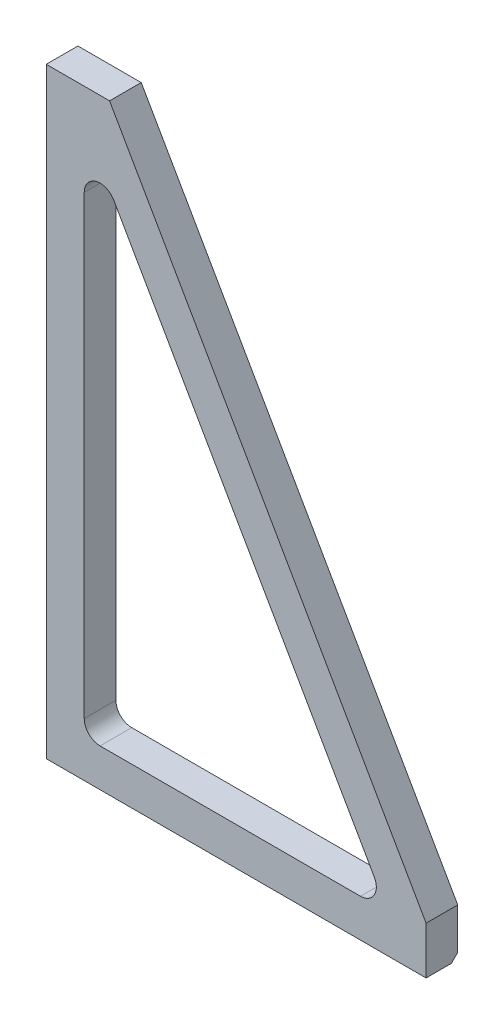
ISO-10303-21;
HEADER;
FILE_DESCRIPTION(('STEP AP214'),'2;1');
FILE_NAME('part.step','',(''),(''),'','','');
FILE_SCHEMA(('AUTOMOTIVE_DESIGN { 1 0 10303 214 1 1 1 1 }'));
ENDSEC;
DATA;
#1=APPLICATION_CONTEXT('core data for automotive mechanical design processes');
#2=APPLICATION_PROTOCOL_DEFINITION('international standard','automotive_design',2000,#1);
#3=PRODUCT_CONTEXT('',#1,'mechanical');
#4=PRODUCT('Part','Part','',(#3));
#5=PRODUCT_RELATED_PRODUCT_CATEGORY('part','',(#4));
#6=PRODUCT_DEFINITION_FORMATION('','',#4);
#7=PRODUCT_DEFINITION_CONTEXT('part definition',#1,'design');
#8=PRODUCT_DEFINITION('design','',#6,#7);
#9=PRODUCT_DEFINITION_SHAPE('','',#8);
#10=(LENGTH_UNIT() NAMED_UNIT(*) SI_UNIT(.MILLI.,.METRE.));
#11=(NAMED_UNIT(*) PLANE_ANGLE_UNIT() SI_UNIT($,.RADIAN.));
#12=(NAMED_UNIT(*) SI_UNIT($,.STERADIAN.) SOLID_ANGLE_UNIT());
#13=UNCERTAINTY_MEASURE_WITH_UNIT(LENGTH_MEASURE(1.E-05),#10,'distance_accuracy_value','');
#14=(GEOMETRIC_REPRESENTATION_CONTEXT(3) GLOBAL_UNCERTAINTY_ASSIGNED_CONTEXT((#13)) GLOBAL_UNIT_ASSIGNED_CONTEXT((#10,
#11,#12)) REPRESENTATION_CONTEXT('',''));
#15=CARTESIAN_POINT('',(0.,0.,0.));
#16=DIRECTION('',(0.,0.,1.));
#17=DIRECTION('',(1.,0.,0.));
#18=AXIS2_PLACEMENT_3D('',#15,#16,#17);
#19=CARTESIAN_POINT('',(0.,241.3,12.7));
#20=DIRECTION('',(0.,0.,-1.));
#21=DIRECTION('',(-1.,0.,0.));
#22=AXIS2_PLACEMENT_3D('',#19,#20,#21);
#23=PLANE('',#22);
#24=DIRECTION('',(0.,-1.,0.));
#25=VECTOR('',#24,1.);
#26=CARTESIAN_POINT('',(0.,0.,12.7));
#27=LINE('',#26,#25);
#28=CARTESIAN_POINT('',(0.,241.3,12.7));
#29=VERTEX_POINT('',#28);
#30=CARTESIAN_POINT('',(0.,0.,12.7));
#31=VERTEX_POINT('',#30);
#32=EDGE_CURVE('E178',#29,#31,#27,.T.);
#33=ORIENTED_EDGE('',*,*,#32,.T.);
#34=DIRECTION('',(1.,0.,0.));
#35=VECTOR('',#34,1.);
#36=CARTESIAN_POINT('',(0.,0.,12.7));
#37=LINE('',#36,#35);
#38=CARTESIAN_POINT('',(152.4,0.,12.7));
#39=VERTEX_POINT('',#38);
#40=EDGE_CURVE('E181',#31,#39,#37,.T.);
#41=ORIENTED_EDGE('',*,*,#40,.T.);
#42=DIRECTION('',(0.,1.,0.));
#43=VECTOR('',#42,1.);
#44=CARTESIAN_POINT('',(152.4,0.,12.7));
#45=LINE('',#44,#43);
#46=CARTESIAN_POINT('',(152.4,19.05,12.7));
#47=VERTEX_POINT('',#46);
#48=EDGE_CURVE('E184',#39,#47,#45,.T.);
#49=ORIENTED_EDGE('',*,*,#48,.T.);
#50=DIRECTION('',(-0.496138938356834,0.868243142124459,0.));
#51=VECTOR('',#50,1.);
#52=CARTESIAN_POINT('',(25.4,241.3,12.7));
#53=LINE('',#52,#51);
#54=CARTESIAN_POINT('',(25.4,241.3,12.7));
#55=VERTEX_POINT('',#54);
#56=EDGE_CURVE('E186',#47,#55,#53,.T.);
#57=ORIENTED_EDGE('',*,*,#56,.T.);
#58=DIRECTION('',(-1.,0.,0.));
#59=VECTOR('',#58,1.);
#60=CARTESIAN_POINT('',(0.,241.3,12.7));
#61=LINE('',#60,#59);
#62=EDGE_CURVE('E188',#55,#29,#61,.T.);
#63=ORIENTED_EDGE('',*,*,#62,.T.);
#64=EDGE_LOOP('',(#33,#41,#49,#57,#63));
#65=FACE_BOUND('',#64,.T.);
#66=CARTESIAN_POINT('',(126.082265030605,21.59,12.7));
#67=DIRECTION('',(0.,0.,1.));
#68=DIRECTION('',(-1.,0.,0.));
#69=AXIS2_PLACEMENT_3D('',#66,#67,#68);
#70=CIRCLE('',#69,6.35);
#71=CARTESIAN_POINT('',(126.082265030605,15.24,12.7));
#72=VERTEX_POINT('',#71);
#73=CARTESIAN_POINT('',(131.595608983095,24.7404822585659,12.7));
#74=VERTEX_POINT('',#73);
#75=EDGE_CURVE('E122',#72,#74,#70,.T.);
#76=ORIENTED_EDGE('',*,*,#75,.F.);
#77=DIRECTION('',(1.,0.,0.));
#78=VECTOR('',#77,1.);
#79=CARTESIAN_POINT('',(21.59,15.24,12.7));
#80=LINE('',#79,#78);
#81=CARTESIAN_POINT('',(21.59,15.24,12.7));
#82=VERTEX_POINT('',#81);
#83=EDGE_CURVE('E154',#82,#72,#80,.T.);
#84=ORIENTED_EDGE('',*,*,#83,.F.);
#85=CARTESIAN_POINT('',(21.59,21.59,12.7));
#86=DIRECTION('',(0.,0.,1.));
#87=DIRECTION('',(1.,0.,0.));
#88=AXIS2_PLACEMENT_3D('',#85,#86,#87);
#89=CIRCLE('',#88,6.35);
#90=CARTESIAN_POINT('',(15.24,21.59,12.7));
#91=VERTEX_POINT('',#90);
#92=EDGE_CURVE('E151',#91,#82,#89,.T.);
#93=ORIENTED_EDGE('',*,*,#92,.F.);
#94=DIRECTION('',(0.,-1.,0.));
#95=VECTOR('',#94,1.);
#96=CARTESIAN_POINT('',(15.24,21.59,12.7));
#97=LINE('',#96,#95);
#98=CARTESIAN_POINT('',(15.24,204.451463803559,12.7));
#99=VERTEX_POINT('',#98);
#100=EDGE_CURVE('E147',#99,#91,#97,.T.);
#101=ORIENTED_EDGE('',*,*,#100,.F.);
#102=CARTESIAN_POINT('',(21.59,204.451463803559,12.7));
#103=DIRECTION('',(0.,0.,1.));
#104=DIRECTION('',(-1.,0.,0.));
#105=AXIS2_PLACEMENT_3D('',#102,#103,#104);
#106=CIRCLE('',#105,6.35000000000001);
#107=CARTESIAN_POINT('',(27.1033439524903,207.601946062124,12.7));
#108=VERTEX_POINT('',#107);
#109=EDGE_CURVE('E145',#108,#99,#106,.T.);
#110=ORIENTED_EDGE('',*,*,#109,.F.);
#111=DIRECTION('',(-0.496138938356834,0.868243142124459,0.));
#112=VECTOR('',#111,1.);
#113=CARTESIAN_POINT('',(27.1033439524903,207.601946062124,12.7));
#114=LINE('',#113,#112);
#115=EDGE_CURVE('E132',#74,#108,#114,.T.);
#116=ORIENTED_EDGE('',*,*,#115,.F.);
#117=EDGE_LOOP('',(#76,#84,#93,#101,#110,#116));
#118=FACE_BOUND('',#117,.T.);
#119=ADVANCED_FACE('F33',(#65,#118),#23,.F.);
#120=CARTESIAN_POINT('',(0.,241.3,0.));
#121=DIRECTION('',(0.,0.,-1.));
#122=DIRECTION('',(-1.,0.,0.));
#123=AXIS2_PLACEMENT_3D('',#120,#121,#122);
#124=PLANE('',#123);
#125=DIRECTION('',(0.,1.,0.));
#126=VECTOR('',#125,1.);
#127=CARTESIAN_POINT('',(152.4,0.,0.));
#128=LINE('',#127,#126);
#129=CARTESIAN_POINT('',(152.4,2.54000000000001,0.));
#130=VERTEX_POINT('',#129);
#131=CARTESIAN_POINT('',(152.4,19.05,0.));
#132=VERTEX_POINT('',#131);
#133=EDGE_CURVE('E192',#130,#132,#128,.T.);
#134=ORIENTED_EDGE('',*,*,#133,.F.);
#135=DIRECTION('',(-1.,0.,0.));
#136=VECTOR('',#135,1.);
#137=CARTESIAN_POINT('',(0.,2.54000000000001,0.));
#138=LINE('',#137,#136);
#139=CARTESIAN_POINT('',(0.,2.54000000000001,0.));
#140=VERTEX_POINT('',#139);
#141=EDGE_CURVE('E41',#130,#140,#138,.T.);
#142=ORIENTED_EDGE('',*,*,#141,.T.);
#143=DIRECTION('',(0.,-1.,0.));
#144=VECTOR('',#143,1.);
#145=CARTESIAN_POINT('',(0.,0.,0.));
#146=LINE('',#145,#144);
#147=CARTESIAN_POINT('',(0.,241.3,0.));
#148=VERTEX_POINT('',#147);
#149=EDGE_CURVE('E140',#148,#140,#146,.T.);
#150=ORIENTED_EDGE('',*,*,#149,.F.);
#151=DIRECTION('',(-1.,0.,0.));
#152=VECTOR('',#151,1.);
#153=CARTESIAN_POINT('',(0.,241.3,0.));
#154=LINE('',#153,#152);
#155=CARTESIAN_POINT('',(25.4,241.3,0.));
#156=VERTEX_POINT('',#155);
#157=EDGE_CURVE('E182',#156,#148,#154,.T.);
#158=ORIENTED_EDGE('',*,*,#157,.F.);
#159=DIRECTION('',(-0.496138938356834,0.868243142124459,0.));
#160=VECTOR('',#159,1.);
#161=CARTESIAN_POINT('',(25.4,241.3,0.));
#162=LINE('',#161,#160);
#163=EDGE_CURVE('E194',#132,#156,#162,.T.);
#164=ORIENTED_EDGE('',*,*,#163,.F.);
#165=EDGE_LOOP('',(#134,#142,#150,#158,#164));
#166=FACE_BOUND('',#165,.T.);
#167=DIRECTION('',(1.,0.,0.));
#168=VECTOR('',#167,1.);
#169=CARTESIAN_POINT('',(21.59,15.24,0.));
#170=LINE('',#169,#168);
#171=CARTESIAN_POINT('',(21.59,15.24,0.));
#172=VERTEX_POINT('',#171);
#173=CARTESIAN_POINT('',(126.082265030605,15.24,0.));
#174=VERTEX_POINT('',#173);
#175=EDGE_CURVE('E133',#172,#174,#170,.T.);
#176=ORIENTED_EDGE('',*,*,#175,.T.);
#177=CARTESIAN_POINT('',(126.082265030605,21.59,0.));
#178=DIRECTION('',(0.,0.,1.));
#179=DIRECTION('',(-1.,0.,0.));
#180=AXIS2_PLACEMENT_3D('',#177,#178,#179);
#181=CIRCLE('',#180,6.35);
#182=CARTESIAN_POINT('',(131.595608983095,24.7404822585659,0.));
#183=VERTEX_POINT('',#182);
#184=EDGE_CURVE('E156',#174,#183,#181,.T.);
#185=ORIENTED_EDGE('',*,*,#184,.T.);
#186=DIRECTION('',(-0.496138938356834,0.868243142124459,0.));
#187=VECTOR('',#186,1.);
#188=CARTESIAN_POINT('',(27.1033439524903,207.601946062124,0.));
#189=LINE('',#188,#187);
#190=CARTESIAN_POINT('',(27.1033439524903,207.601946062124,0.));
#191=VERTEX_POINT('',#190);
#192=EDGE_CURVE('E139',#183,#191,#189,.T.);
#193=ORIENTED_EDGE('',*,*,#192,.T.);
#194=CARTESIAN_POINT('',(21.59,204.451463803559,0.));
#195=DIRECTION('',(0.,0.,1.));
#196=DIRECTION('',(-1.,0.,0.));
#197=AXIS2_PLACEMENT_3D('',#194,#195,#196);
#198=CIRCLE('',#197,6.35000000000001);
#199=CARTESIAN_POINT('',(15.24,204.451463803559,0.));
#200=VERTEX_POINT('',#199);
#201=EDGE_CURVE('E159',#191,#200,#198,.T.);
#202=ORIENTED_EDGE('',*,*,#201,.T.);
#203=DIRECTION('',(0.,-1.,0.));
#204=VECTOR('',#203,1.);
#205=CARTESIAN_POINT('',(15.24,21.59,0.));
#206=LINE('',#205,#204);
#207=CARTESIAN_POINT('',(15.24,21.59,0.));
#208=VERTEX_POINT('',#207);
#209=EDGE_CURVE('E162',#200,#208,#206,.T.);
#210=ORIENTED_EDGE('',*,*,#209,.T.);
#211=CARTESIAN_POINT('',(21.59,21.59,0.));
#212=DIRECTION('',(0.,0.,1.));
#213=DIRECTION('',(1.,0.,0.));
#214=AXIS2_PLACEMENT_3D('',#211,#212,#213);
#215=CIRCLE('',#214,6.35);
#216=EDGE_CURVE('E165',#208,#172,#215,.T.);
#217=ORIENTED_EDGE('',*,*,#216,.T.);
#218=EDGE_LOOP('',(#176,#185,#193,#202,#210,#217));
#219=FACE_BOUND('',#218,.T.);
#220=ADVANCED_FACE('F240',(#166,#219),#124,.T.);
#221=CARTESIAN_POINT('',(0.,0.,12.7));
#222=DIRECTION('',(1.,0.,0.));
#223=DIRECTION('',(0.,0.,-1.));
#224=AXIS2_PLACEMENT_3D('',#221,#222,#223);
#225=PLANE('',#224);
#226=ORIENTED_EDGE('',*,*,#149,.T.);
#227=DIRECTION('',(0.,-0.70710678118655,0.707106781186546));
#228=VECTOR('',#227,1.);
#229=CARTESIAN_POINT('',(0.,0.,2.54));
#230=LINE('',#229,#228);
#231=CARTESIAN_POINT('',(0.,0.,2.54));
#232=VERTEX_POINT('',#231);
#233=EDGE_CURVE('E11',#140,#232,#230,.T.);
#234=ORIENTED_EDGE('',*,*,#233,.T.);
#235=DIRECTION('',(0.,0.,-1.));
#236=VECTOR('',#235,1.);
#237=CARTESIAN_POINT('',(0.,0.,12.7));
#238=LINE('',#237,#236);
#239=EDGE_CURVE('E207',#31,#232,#238,.T.);
#240=ORIENTED_EDGE('',*,*,#239,.F.);
#241=ORIENTED_EDGE('',*,*,#32,.F.);
#242=DIRECTION('',(0.,0.,-1.));
#243=VECTOR('',#242,1.);
#244=CARTESIAN_POINT('',(0.,241.3,12.7));
#245=LINE('',#244,#243);
#246=EDGE_CURVE('E190',#29,#148,#245,.T.);
#247=ORIENTED_EDGE('',*,*,#246,.T.);
#248=EDGE_LOOP('',(#226,#234,#240,#241,#247));
#249=FACE_BOUND('',#248,.T.);
#250=ADVANCED_FACE('F230',(#249),#225,.F.);
#251=CARTESIAN_POINT('',(0.,0.,12.7));
#252=DIRECTION('',(0.,1.,0.));
#253=DIRECTION('',(0.,0.,1.));
#254=AXIS2_PLACEMENT_3D('',#251,#252,#253);
#255=PLANE('',#254);
#256=ORIENTED_EDGE('',*,*,#239,.T.);
#257=DIRECTION('',(1.,0.,0.));
#258=VECTOR('',#257,1.);
#259=CARTESIAN_POINT('',(152.4,0.,2.54));
#260=LINE('',#259,#258);
#261=CARTESIAN_POINT('',(152.4,0.,2.54));
#262=VERTEX_POINT('',#261);
#263=EDGE_CURVE('E210',#232,#262,#260,.T.);
#264=ORIENTED_EDGE('',*,*,#263,.T.);
#265=DIRECTION('',(0.,0.,-1.));
#266=VECTOR('',#265,1.);
#267=CARTESIAN_POINT('',(152.4,0.,12.7));
#268=LINE('',#267,#266);
#269=EDGE_CURVE('E205',#39,#262,#268,.T.);
#270=ORIENTED_EDGE('',*,*,#269,.F.);
#271=ORIENTED_EDGE('',*,*,#40,.F.);
#272=EDGE_LOOP('',(#256,#264,#270,#271));
#273=FACE_BOUND('',#272,.T.);
#274=ADVANCED_FACE('F216',(#273),#255,.F.);
#275=CARTESIAN_POINT('',(152.4,0.,12.7));
#276=DIRECTION('',(-1.,0.,0.));
#277=DIRECTION('',(0.,0.,1.));
#278=AXIS2_PLACEMENT_3D('',#275,#276,#277);
#279=PLANE('',#278);
#280=ORIENTED_EDGE('',*,*,#269,.T.);
#281=DIRECTION('',(0.,0.70710678118655,-0.707106781186546));
#282=VECTOR('',#281,1.);
#283=CARTESIAN_POINT('',(152.4,0.,2.54));
#284=LINE('',#283,#282);
#285=EDGE_CURVE('E55',#262,#130,#284,.T.);
#286=ORIENTED_EDGE('',*,*,#285,.T.);
#287=ORIENTED_EDGE('',*,*,#133,.T.);
#288=DIRECTION('',(0.,0.,-1.));
#289=VECTOR('',#288,1.);
#290=CARTESIAN_POINT('',(152.4,19.05,12.7));
#291=LINE('',#290,#289);
#292=EDGE_CURVE('E202',#47,#132,#291,.T.);
#293=ORIENTED_EDGE('',*,*,#292,.F.);
#294=ORIENTED_EDGE('',*,*,#48,.F.);
#295=EDGE_LOOP('',(#280,#286,#287,#293,#294));
#296=FACE_BOUND('',#295,.T.);
#297=ADVANCED_FACE('F221',(#296),#279,.F.);
#298=CARTESIAN_POINT('',(25.4,241.3,12.7));
#299=DIRECTION('',(-0.868243142124459,-0.496138938356834,0.));
#300=DIRECTION('',(0.496138938356834,-0.868243142124459,0.));
#301=AXIS2_PLACEMENT_3D('',#298,#299,#300);
#302=PLANE('',#301);
#303=ORIENTED_EDGE('',*,*,#163,.T.);
#304=DIRECTION('',(0.,0.,-1.));
#305=VECTOR('',#304,1.);
#306=CARTESIAN_POINT('',(25.4,241.3,12.7));
#307=LINE('',#306,#305);
#308=EDGE_CURVE('E199',#55,#156,#307,.T.);
#309=ORIENTED_EDGE('',*,*,#308,.F.);
#310=ORIENTED_EDGE('',*,*,#56,.F.);
#311=ORIENTED_EDGE('',*,*,#292,.T.);
#312=EDGE_LOOP('',(#303,#309,#310,#311));
#313=FACE_BOUND('',#312,.T.);
#314=ADVANCED_FACE('F252',(#313),#302,.F.);
#315=CARTESIAN_POINT('',(0.,241.3,12.7));
#316=DIRECTION('',(0.,-1.,0.));
#317=DIRECTION('',(0.,0.,-1.));
#318=AXIS2_PLACEMENT_3D('',#315,#316,#317);
#319=PLANE('',#318);
#320=ORIENTED_EDGE('',*,*,#157,.T.);
#321=ORIENTED_EDGE('',*,*,#246,.F.);
#322=ORIENTED_EDGE('',*,*,#62,.F.);
#323=ORIENTED_EDGE('',*,*,#308,.T.);
#324=EDGE_LOOP('',(#320,#321,#322,#323));
#325=FACE_BOUND('',#324,.T.);
#326=ADVANCED_FACE('F249',(#325),#319,.F.);
#327=CARTESIAN_POINT('',(126.082265030605,21.59,12.7));
#328=DIRECTION('',(0.,0.,-1.));
#329=DIRECTION('',(-1.,0.,0.));
#330=AXIS2_PLACEMENT_3D('',#327,#328,#329);
#331=CYLINDRICAL_SURFACE('',#330,6.35);
#332=ORIENTED_EDGE('',*,*,#184,.F.);
#333=DIRECTION('',(0.,0.,-1.));
#334=VECTOR('',#333,1.);
#335=CARTESIAN_POINT('',(126.082265030605,15.24,12.7));
#336=LINE('',#335,#334);
#337=EDGE_CURVE('E128',#72,#174,#336,.T.);
#338=ORIENTED_EDGE('',*,*,#337,.F.);
#339=ORIENTED_EDGE('',*,*,#75,.T.);
#340=DIRECTION('',(0.,0.,-1.));
#341=VECTOR('',#340,1.);
#342=CARTESIAN_POINT('',(131.595608983095,24.7404822585659,12.7));
#343=LINE('',#342,#341);
#344=EDGE_CURVE('E125',#74,#183,#343,.T.);
#345=ORIENTED_EDGE('',*,*,#344,.T.);
#346=EDGE_LOOP('',(#332,#338,#339,#345));
#347=FACE_BOUND('',#346,.T.);
#348=ADVANCED_FACE('F124',(#347),#331,.F.);
#349=CARTESIAN_POINT('',(27.1033439524903,207.601946062124,12.7));
#350=DIRECTION('',(-0.868243142124459,-0.496138938356834,0.));
#351=DIRECTION('',(0.496138938356834,-0.868243142124459,0.));
#352=AXIS2_PLACEMENT_3D('',#349,#350,#351);
#353=PLANE('',#352);
#354=ORIENTED_EDGE('',*,*,#192,.F.);
#355=ORIENTED_EDGE('',*,*,#344,.F.);
#356=ORIENTED_EDGE('',*,*,#115,.T.);
#357=DIRECTION('',(0.,0.,-1.));
#358=VECTOR('',#357,1.);
#359=CARTESIAN_POINT('',(27.1033439524903,207.601946062124,12.7));
#360=LINE('',#359,#358);
#361=EDGE_CURVE('E141',#108,#191,#360,.T.);
#362=ORIENTED_EDGE('',*,*,#361,.T.);
#363=EDGE_LOOP('',(#354,#355,#356,#362));
#364=FACE_BOUND('',#363,.T.);
#365=ADVANCED_FACE('F136',(#364),#353,.T.);
#366=CARTESIAN_POINT('',(21.59,204.451463803559,12.7));
#367=DIRECTION('',(0.,0.,-1.));
#368=DIRECTION('',(-1.,0.,0.));
#369=AXIS2_PLACEMENT_3D('',#366,#367,#368);
#370=CYLINDRICAL_SURFACE('',#369,6.35000000000001);
#371=ORIENTED_EDGE('',*,*,#201,.F.);
#372=ORIENTED_EDGE('',*,*,#361,.F.);
#373=ORIENTED_EDGE('',*,*,#109,.T.);
#374=DIRECTION('',(0.,0.,-1.));
#375=VECTOR('',#374,1.);
#376=CARTESIAN_POINT('',(15.24,204.451463803559,12.7));
#377=LINE('',#376,#375);
#378=EDGE_CURVE('E175',#99,#200,#377,.T.);
#379=ORIENTED_EDGE('',*,*,#378,.T.);
#380=EDGE_LOOP('',(#371,#372,#373,#379));
#381=FACE_BOUND('',#380,.T.);
#382=ADVANCED_FACE('F292',(#381),#370,.F.);
#383=CARTESIAN_POINT('',(15.24,21.59,12.7));
#384=DIRECTION('',(1.,0.,0.));
#385=DIRECTION('',(0.,0.,-1.));
#386=AXIS2_PLACEMENT_3D('',#383,#384,#385);
#387=PLANE('',#386);
#388=ORIENTED_EDGE('',*,*,#209,.F.);
#389=ORIENTED_EDGE('',*,*,#378,.F.);
#390=ORIENTED_EDGE('',*,*,#100,.T.);
#391=DIRECTION('',(0.,0.,-1.));
#392=VECTOR('',#391,1.);
#393=CARTESIAN_POINT('',(15.24,21.59,12.7));
#394=LINE('',#393,#392);
#395=EDGE_CURVE('E173',#91,#208,#394,.T.);
#396=ORIENTED_EDGE('',*,*,#395,.T.);
#397=EDGE_LOOP('',(#388,#389,#390,#396));
#398=FACE_BOUND('',#397,.T.);
#399=ADVANCED_FACE('F298',(#398),#387,.T.);
#400=CARTESIAN_POINT('',(21.59,21.59,12.7));
#401=DIRECTION('',(0.,0.,-1.));
#402=DIRECTION('',(-1.,0.,0.));
#403=AXIS2_PLACEMENT_3D('',#400,#401,#402);
#404=CYLINDRICAL_SURFACE('',#403,6.35);
#405=ORIENTED_EDGE('',*,*,#216,.F.);
#406=ORIENTED_EDGE('',*,*,#395,.F.);
#407=ORIENTED_EDGE('',*,*,#92,.T.);
#408=DIRECTION('',(0.,0.,-1.));
#409=VECTOR('',#408,1.);
#410=CARTESIAN_POINT('',(21.59,15.24,12.7));
#411=LINE('',#410,#409);
#412=EDGE_CURVE('E171',#82,#172,#411,.T.);
#413=ORIENTED_EDGE('',*,*,#412,.T.);
#414=EDGE_LOOP('',(#405,#406,#407,#413));
#415=FACE_BOUND('',#414,.T.);
#416=ADVANCED_FACE('F236',(#415),#404,.F.);
#417=CARTESIAN_POINT('',(21.59,15.24,12.7));
#418=DIRECTION('',(0.,1.,0.));
#419=DIRECTION('',(0.,0.,1.));
#420=AXIS2_PLACEMENT_3D('',#417,#418,#419);
#421=PLANE('',#420);
#422=ORIENTED_EDGE('',*,*,#175,.F.);
#423=ORIENTED_EDGE('',*,*,#412,.F.);
#424=ORIENTED_EDGE('',*,*,#83,.T.);
#425=ORIENTED_EDGE('',*,*,#337,.T.);
#426=EDGE_LOOP('',(#422,#423,#424,#425));
#427=FACE_BOUND('',#426,.T.);
#428=ADVANCED_FACE('F232',(#427),#421,.T.);
#429=CARTESIAN_POINT('',(0.,0.,2.54));
#430=DIRECTION('',(0.,-0.707106781186546,-0.70710678118655));
#431=DIRECTION('',(0.,0.70710678118655,-0.707106781186546));
#432=AXIS2_PLACEMENT_3D('',#429,#430,#431);
#433=PLANE('',#432);
#434=ORIENTED_EDGE('',*,*,#233,.F.);
#435=ORIENTED_EDGE('',*,*,#141,.F.);
#436=ORIENTED_EDGE('',*,*,#285,.F.);
#437=ORIENTED_EDGE('',*,*,#263,.F.);
#438=EDGE_LOOP('',(#434,#435,#436,#437));
#439=FACE_BOUND('',#438,.T.);
#440=ADVANCED_FACE('F35',(#439),#433,.T.);
#441=CLOSED_SHELL('',(#119,#220,#250,#274,#297,#314,#326,#348,#365,#382,#399,#416,#428,#440));
#442=MANIFOLD_SOLID_BREP('B2',#441);
#443=ADVANCED_BREP_SHAPE_REPRESENTATION('',(#18,#442),#14);
#444=SHAPE_DEFINITION_REPRESENTATION(#9,#443);
ENDSEC;
END-ISO-10303-21;
